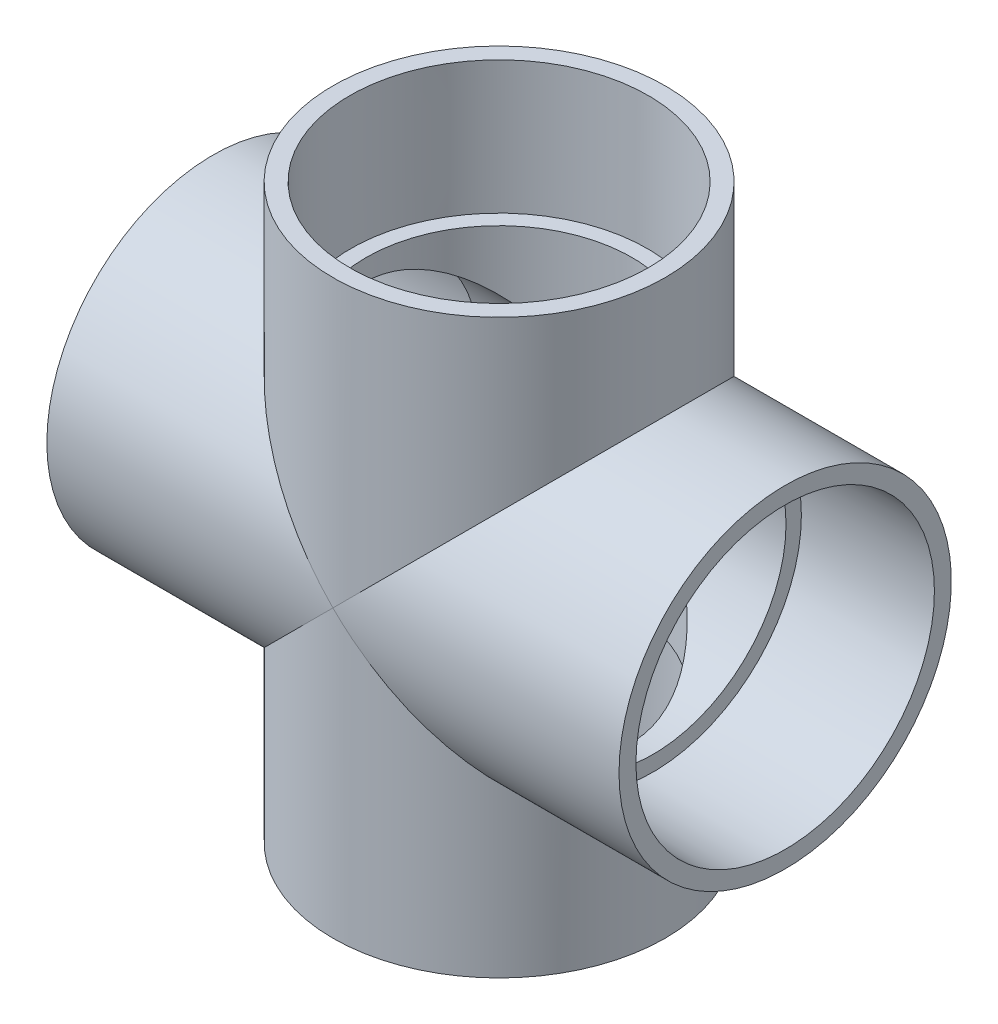
ISO-10303-21;
HEADER;
FILE_DESCRIPTION(('STEP AP214'),'2;1');
FILE_NAME('part.step','',(''),(''),'','','');
FILE_SCHEMA(('AUTOMOTIVE_DESIGN { 1 0 10303 214 1 1 1 1 }'));
ENDSEC;
DATA;
#1=APPLICATION_CONTEXT('core data for automotive mechanical design processes');
#2=APPLICATION_PROTOCOL_DEFINITION('international standard','automotive_design',2000,#1);
#3=PRODUCT_CONTEXT('',#1,'mechanical');
#4=PRODUCT('Part','Part','',(#3));
#5=PRODUCT_RELATED_PRODUCT_CATEGORY('part','',(#4));
#6=PRODUCT_DEFINITION_FORMATION('','',#4);
#7=PRODUCT_DEFINITION_CONTEXT('part definition',#1,'design');
#8=PRODUCT_DEFINITION('design','',#6,#7);
#9=PRODUCT_DEFINITION_SHAPE('','',#8);
#10=(LENGTH_UNIT() NAMED_UNIT(*) SI_UNIT(.MILLI.,.METRE.));
#11=(NAMED_UNIT(*) PLANE_ANGLE_UNIT() SI_UNIT($,.RADIAN.));
#12=(NAMED_UNIT(*) SI_UNIT($,.STERADIAN.) SOLID_ANGLE_UNIT());
#13=UNCERTAINTY_MEASURE_WITH_UNIT(LENGTH_MEASURE(1.E-05),#10,'distance_accuracy_value','');
#14=(GEOMETRIC_REPRESENTATION_CONTEXT(3) GLOBAL_UNCERTAINTY_ASSIGNED_CONTEXT((#13)) GLOBAL_UNIT_ASSIGNED_CONTEXT((#10,
#11,#12)) REPRESENTATION_CONTEXT('',''));
#15=CARTESIAN_POINT('',(0.,0.,0.));
#16=DIRECTION('',(0.,0.,1.));
#17=DIRECTION('',(1.,0.,0.));
#18=AXIS2_PLACEMENT_3D('',#15,#16,#17);
#19=CARTESIAN_POINT('',(0.,59.1819999999998,0.));
#20=DIRECTION('',(0.,-1.,0.));
#21=DIRECTION('',(1.,0.,0.));
#22=AXIS2_PLACEMENT_3D('',#19,#20,#21);
#23=PLANE('',#22);
#24=CARTESIAN_POINT('',(0.,59.1819999999998,0.));
#25=DIRECTION('',(0.,-1.,0.));
#26=DIRECTION('',(1.,0.,0.));
#27=AXIS2_PLACEMENT_3D('',#24,#25,#26);
#28=CIRCLE('',#27,57.0357);
#29=CARTESIAN_POINT('',(57.0357,59.1819999999998,0.));
#30=VERTEX_POINT('',#29);
#31=EDGE_CURVE('E80',#30,#30,#28,.T.);
#32=ORIENTED_EDGE('',*,*,#31,.F.);
#33=EDGE_LOOP('',(#32));
#34=FACE_BOUND('',#33,.T.);
#35=CARTESIAN_POINT('',(0.,59.1819999999998,0.));
#36=DIRECTION('',(0.,1.,0.));
#37=DIRECTION('',(-1.,0.,0.));
#38=AXIS2_PLACEMENT_3D('',#35,#36,#37);
#39=CIRCLE('',#38,51.1302);
#40=CARTESIAN_POINT('',(-51.1302,59.1819999999998,0.));
#41=VERTEX_POINT('',#40);
#42=EDGE_CURVE('E124',#41,#41,#39,.T.);
#43=ORIENTED_EDGE('',*,*,#42,.F.);
#44=EDGE_LOOP('',(#43));
#45=FACE_BOUND('',#44,.T.);
#46=ADVANCED_FACE('F32',(#34,#45),#23,.F.);
#47=CARTESIAN_POINT('',(0.,-59.1819999999998,0.));
#48=DIRECTION('',(0.,-1.,0.));
#49=DIRECTION('',(1.,0.,0.));
#50=AXIS2_PLACEMENT_3D('',#47,#48,#49);
#51=PLANE('',#50);
#52=CARTESIAN_POINT('',(0.,-59.1819999999998,0.));
#53=DIRECTION('',(0.,1.,0.));
#54=DIRECTION('',(-1.,0.,0.));
#55=AXIS2_PLACEMENT_3D('',#52,#53,#54);
#56=CIRCLE('',#55,51.1302);
#57=CARTESIAN_POINT('',(-51.1302,-59.1819999999999,0.));
#58=VERTEX_POINT('',#57);
#59=EDGE_CURVE('E127',#58,#58,#56,.T.);
#60=ORIENTED_EDGE('',*,*,#59,.T.);
#61=EDGE_LOOP('',(#60));
#62=FACE_BOUND('',#61,.T.);
#63=CARTESIAN_POINT('',(0.,-59.1819999999998,0.));
#64=DIRECTION('',(0.,-1.,0.));
#65=DIRECTION('',(1.,0.,0.));
#66=AXIS2_PLACEMENT_3D('',#63,#64,#65);
#67=CIRCLE('',#66,57.0357);
#68=CARTESIAN_POINT('',(57.0357,-59.1819999999998,0.));
#69=VERTEX_POINT('',#68);
#70=EDGE_CURVE('E115',#69,#69,#67,.T.);
#71=ORIENTED_EDGE('',*,*,#70,.T.);
#72=EDGE_LOOP('',(#71));
#73=FACE_BOUND('',#72,.T.);
#74=ADVANCED_FACE('F131',(#62,#73),#51,.T.);
#75=CARTESIAN_POINT('',(109.982,0.,0.));
#76=DIRECTION('',(1.,0.,0.));
#77=DIRECTION('',(0.,0.,-1.));
#78=AXIS2_PLACEMENT_3D('',#75,#76,#77);
#79=CYLINDRICAL_SURFACE('',#78,51.1302);
#80=CARTESIAN_POINT('',(59.1819999999998,0.,0.));
#81=DIRECTION('',(1.,0.,0.));
#82=DIRECTION('',(0.,0.,-1.));
#83=AXIS2_PLACEMENT_3D('',#80,#81,#82);
#84=CIRCLE('',#83,51.1302);
#85=CARTESIAN_POINT('',(59.1819999999998,0.,-51.1302));
#86=VERTEX_POINT('',#85);
#87=EDGE_CURVE('E121',#86,#86,#84,.T.);
#88=ORIENTED_EDGE('',*,*,#87,.T.);
#89=EDGE_LOOP('',(#88));
#90=FACE_BOUND('',#89,.T.);
#91=CARTESIAN_POINT('',(0.,0.,0.));
#92=DIRECTION('',(0.707106781186548,-0.707106781186547,0.));
#93=DIRECTION('',(0.707106781186547,0.707106781186548,0.));
#94=AXIS2_PLACEMENT_3D('',#91,#92,#93);
#95=ELLIPSE('',#94,72.3090222868488,51.1302);
#96=CARTESIAN_POINT('',(0.,0.,51.1302));
#97=VERTEX_POINT('',#96);
#98=CARTESIAN_POINT('',(0.,0.,-51.1302));
#99=VERTEX_POINT('',#98);
#100=EDGE_CURVE('E45',#97,#99,#95,.F.);
#101=ORIENTED_EDGE('',*,*,#100,.T.);
#102=CARTESIAN_POINT('',(0.,0.,0.));
#103=DIRECTION('',(0.707106781186547,0.707106781186548,0.));
#104=DIRECTION('',(0.707106781186548,-0.707106781186547,0.));
#105=AXIS2_PLACEMENT_3D('',#102,#103,#104);
#106=ELLIPSE('',#105,72.3090222868488,51.1302);
#107=EDGE_CURVE('E11',#99,#97,#106,.F.);
#108=ORIENTED_EDGE('',*,*,#107,.T.);
#109=EDGE_LOOP('',(#101,#108));
#110=FACE_BOUND('',#109,.T.);
#111=ADVANCED_FACE('F72',(#90,#110),#79,.F.);
#112=CARTESIAN_POINT('',(-59.1819999999998,0.,0.));
#113=DIRECTION('',(1.,0.,0.));
#114=DIRECTION('',(0.,0.,-1.));
#115=AXIS2_PLACEMENT_3D('',#112,#113,#114);
#116=CIRCLE('',#115,51.1302);
#117=CARTESIAN_POINT('',(-59.1819999999998,0.,-51.1302));
#118=VERTEX_POINT('',#117);
#119=EDGE_CURVE('E118',#118,#118,#116,.T.);
#120=ORIENTED_EDGE('',*,*,#119,.F.);
#121=EDGE_LOOP('',(#120));
#122=FACE_BOUND('',#121,.T.);
#123=CARTESIAN_POINT('',(0.,0.,0.));
#124=DIRECTION('',(0.707106781186548,-0.707106781186547,0.));
#125=DIRECTION('',(0.707106781186547,0.707106781186548,0.));
#126=AXIS2_PLACEMENT_3D('',#123,#124,#125);
#127=ELLIPSE('',#126,72.3090222868488,51.1302);
#128=EDGE_CURVE('E62',#97,#99,#127,.T.);
#129=ORIENTED_EDGE('',*,*,#128,.T.);
#130=CARTESIAN_POINT('',(0.,0.,0.));
#131=DIRECTION('',(0.707106781186547,0.707106781186548,0.));
#132=DIRECTION('',(0.707106781186548,-0.707106781186547,0.));
#133=AXIS2_PLACEMENT_3D('',#130,#131,#132);
#134=ELLIPSE('',#133,72.3090222868488,51.1302);
#135=EDGE_CURVE('E40',#99,#97,#134,.T.);
#136=ORIENTED_EDGE('',*,*,#135,.T.);
#137=EDGE_LOOP('',(#129,#136));
#138=FACE_BOUND('',#137,.T.);
#139=ADVANCED_FACE('F73',(#122,#138),#79,.F.);
#140=CARTESIAN_POINT('',(-59.1819999999998,0.,0.));
#141=DIRECTION('',(1.,0.,0.));
#142=DIRECTION('',(0.,0.,-1.));
#143=AXIS2_PLACEMENT_3D('',#140,#141,#142);
#144=PLANE('',#143);
#145=ORIENTED_EDGE('',*,*,#119,.T.);
#146=EDGE_LOOP('',(#145));
#147=FACE_BOUND('',#146,.T.);
#148=CARTESIAN_POINT('',(-59.1819999999998,0.,0.));
#149=DIRECTION('',(-1.,0.,0.));
#150=DIRECTION('',(0.,0.,1.));
#151=AXIS2_PLACEMENT_3D('',#148,#149,#150);
#152=CIRCLE('',#151,57.0357);
#153=CARTESIAN_POINT('',(-59.1819999999998,0.,57.0357));
#154=VERTEX_POINT('',#153);
#155=EDGE_CURVE('E92',#154,#154,#152,.T.);
#156=ORIENTED_EDGE('',*,*,#155,.T.);
#157=EDGE_LOOP('',(#156));
#158=FACE_BOUND('',#157,.T.);
#159=ADVANCED_FACE('F179',(#147,#158),#144,.F.);
#160=CARTESIAN_POINT('',(59.1819999999998,0.,0.));
#161=DIRECTION('',(1.,0.,0.));
#162=DIRECTION('',(0.,0.,-1.));
#163=AXIS2_PLACEMENT_3D('',#160,#161,#162);
#164=PLANE('',#163);
#165=CARTESIAN_POINT('',(59.1819999999998,0.,0.));
#166=DIRECTION('',(1.,0.,0.));
#167=DIRECTION('',(0.,0.,-1.));
#168=AXIS2_PLACEMENT_3D('',#165,#166,#167);
#169=CIRCLE('',#168,57.0357);
#170=CARTESIAN_POINT('',(59.1819999999998,0.,-57.0357));
#171=VERTEX_POINT('',#170);
#172=EDGE_CURVE('E70',#171,#171,#169,.F.);
#173=ORIENTED_EDGE('',*,*,#172,.F.);
#174=EDGE_LOOP('',(#173));
#175=FACE_BOUND('',#174,.T.);
#176=ORIENTED_EDGE('',*,*,#87,.F.);
#177=EDGE_LOOP('',(#176));
#178=FACE_BOUND('',#177,.T.);
#179=ADVANCED_FACE('F175',(#175,#178),#164,.T.);
#180=CARTESIAN_POINT('',(59.1819999999998,0.,0.));
#181=DIRECTION('',(-1.,0.,0.));
#182=DIRECTION('',(0.,0.,1.));
#183=AXIS2_PLACEMENT_3D('',#180,#181,#182);
#184=CYLINDRICAL_SURFACE('',#183,63.881);
#185=CARTESIAN_POINT('',(109.982,0.,0.));
#186=DIRECTION('',(-1.,0.,0.));
#187=DIRECTION('',(0.,0.,1.));
#188=AXIS2_PLACEMENT_3D('',#185,#186,#187);
#189=CIRCLE('',#188,63.881);
#190=CARTESIAN_POINT('',(109.982,0.,63.881));
#191=VERTEX_POINT('',#190);
#192=EDGE_CURVE('E103',#191,#191,#189,.T.);
#193=ORIENTED_EDGE('',*,*,#192,.T.);
#194=EDGE_LOOP('',(#193));
#195=FACE_BOUND('',#194,.T.);
#196=CARTESIAN_POINT('',(0.,0.,0.));
#197=DIRECTION('',(-0.707106781186547,-0.707106781186548,0.));
#198=DIRECTION('',(-0.707106781186547,0.707106781186548,0.));
#199=AXIS2_PLACEMENT_3D('',#196,#197,#198);
#200=ELLIPSE('',#199,90.3413765779557,63.881);
#201=CARTESIAN_POINT('',(0.,0.,-63.8810000000001));
#202=VERTEX_POINT('',#201);
#203=CARTESIAN_POINT('',(0.,0.,63.8810000000001));
#204=VERTEX_POINT('',#203);
#205=EDGE_CURVE('E107',#202,#204,#200,.T.);
#206=ORIENTED_EDGE('',*,*,#205,.F.);
#207=CARTESIAN_POINT('',(0.,0.,0.));
#208=DIRECTION('',(0.707106781186547,-0.707106781186547,0.));
#209=DIRECTION('',(-0.707106781186547,-0.707106781186547,0.));
#210=AXIS2_PLACEMENT_3D('',#207,#208,#209);
#211=ELLIPSE('',#210,90.3413765779557,63.881);
#212=EDGE_CURVE('E98',#202,#204,#211,.T.);
#213=ORIENTED_EDGE('',*,*,#212,.T.);
#214=EDGE_LOOP('',(#206,#213));
#215=FACE_BOUND('',#214,.T.);
#216=ADVANCED_FACE('F178',(#195,#215),#184,.T.);
#217=CARTESIAN_POINT('',(-109.982,0.,0.));
#218=DIRECTION('',(-1.,0.,0.));
#219=DIRECTION('',(0.,0.,1.));
#220=AXIS2_PLACEMENT_3D('',#217,#218,#219);
#221=CIRCLE('',#220,63.881);
#222=CARTESIAN_POINT('',(-109.982,0.,63.881));
#223=VERTEX_POINT('',#222);
#224=EDGE_CURVE('E95',#223,#223,#221,.T.);
#225=ORIENTED_EDGE('',*,*,#224,.F.);
#226=EDGE_LOOP('',(#225));
#227=FACE_BOUND('',#226,.T.);
#228=CARTESIAN_POINT('',(0.,0.,0.));
#229=DIRECTION('',(-0.707106781186547,-0.707106781186547,0.));
#230=DIRECTION('',(0.707106781186547,-0.707106781186547,0.));
#231=AXIS2_PLACEMENT_3D('',#228,#229,#230);
#232=ELLIPSE('',#231,90.3413765779557,63.881);
#233=EDGE_CURVE('E86',#204,#202,#232,.T.);
#234=ORIENTED_EDGE('',*,*,#233,.T.);
#235=CARTESIAN_POINT('',(0.,0.,0.));
#236=DIRECTION('',(-0.707106781186547,0.707106781186548,0.));
#237=DIRECTION('',(-0.707106781186547,-0.707106781186548,0.));
#238=AXIS2_PLACEMENT_3D('',#235,#236,#237);
#239=ELLIPSE('',#238,90.3413765779557,63.881);
#240=EDGE_CURVE('E52',#204,#202,#239,.F.);
#241=ORIENTED_EDGE('',*,*,#240,.F.);
#242=EDGE_LOOP('',(#234,#241));
#243=FACE_BOUND('',#242,.T.);
#244=ADVANCED_FACE('F169',(#227,#243),#184,.T.);
#245=CARTESIAN_POINT('',(-59.1819999999998,0.,0.));
#246=DIRECTION('',(-1.,0.,0.));
#247=DIRECTION('',(0.,0.,1.));
#248=AXIS2_PLACEMENT_3D('',#245,#246,#247);
#249=CONICAL_SURFACE('',#248,57.0357,0.00674989748717743);
#250=CARTESIAN_POINT('',(-109.982,0.,0.));
#251=DIRECTION('',(-1.,0.,0.));
#252=DIRECTION('',(0.,0.,1.));
#253=AXIS2_PLACEMENT_3D('',#250,#251,#252);
#254=CIRCLE('',#253,57.3786);
#255=CARTESIAN_POINT('',(-109.982,0.,57.3786));
#256=VERTEX_POINT('',#255);
#257=EDGE_CURVE('E89',#256,#256,#254,.T.);
#258=ORIENTED_EDGE('',*,*,#257,.T.);
#259=EDGE_LOOP('',(#258));
#260=FACE_BOUND('',#259,.T.);
#261=ORIENTED_EDGE('',*,*,#155,.F.);
#262=EDGE_LOOP('',(#261));
#263=FACE_BOUND('',#262,.T.);
#264=ADVANCED_FACE('F161',(#260,#263),#249,.F.);
#265=CARTESIAN_POINT('',(109.982,0.,0.));
#266=DIRECTION('',(1.,0.,0.));
#267=DIRECTION('',(0.,0.,-1.));
#268=AXIS2_PLACEMENT_3D('',#265,#266,#267);
#269=CONICAL_SURFACE('',#268,57.3786,0.00674989748717716);
#270=CARTESIAN_POINT('',(109.982,0.,0.));
#271=DIRECTION('',(-1.,0.,0.));
#272=DIRECTION('',(0.,0.,1.));
#273=AXIS2_PLACEMENT_3D('',#270,#271,#272);
#274=CIRCLE('',#273,57.3786);
#275=CARTESIAN_POINT('',(109.982,0.,57.3786));
#276=VERTEX_POINT('',#275);
#277=EDGE_CURVE('E100',#276,#276,#274,.T.);
#278=ORIENTED_EDGE('',*,*,#277,.F.);
#279=EDGE_LOOP('',(#278));
#280=FACE_BOUND('',#279,.T.);
#281=ORIENTED_EDGE('',*,*,#172,.T.);
#282=EDGE_LOOP('',(#281));
#283=FACE_BOUND('',#282,.T.);
#284=ADVANCED_FACE('F157',(#280,#283),#269,.F.);
#285=CARTESIAN_POINT('',(0.,109.982,0.));
#286=DIRECTION('',(0.,1.,0.));
#287=DIRECTION('',(-1.,0.,0.));
#288=AXIS2_PLACEMENT_3D('',#285,#286,#287);
#289=CONICAL_SURFACE('',#288,57.3786,0.00674989748717743);
#290=CARTESIAN_POINT('',(0.,109.982,0.));
#291=DIRECTION('',(0.,-1.,0.));
#292=DIRECTION('',(1.,0.,0.));
#293=AXIS2_PLACEMENT_3D('',#290,#291,#292);
#294=CIRCLE('',#293,57.3786);
#295=CARTESIAN_POINT('',(57.3786,109.982,0.));
#296=VERTEX_POINT('',#295);
#297=EDGE_CURVE('E83',#296,#296,#294,.T.);
#298=ORIENTED_EDGE('',*,*,#297,.F.);
#299=EDGE_LOOP('',(#298));
#300=FACE_BOUND('',#299,.T.);
#301=ORIENTED_EDGE('',*,*,#31,.T.);
#302=EDGE_LOOP('',(#301));
#303=FACE_BOUND('',#302,.T.);
#304=ADVANCED_FACE('F160',(#300,#303),#289,.F.);
#305=CARTESIAN_POINT('',(63.8809999999999,109.982,0.));
#306=DIRECTION('',(0.,1.,0.));
#307=DIRECTION('',(-1.,0.,0.));
#308=AXIS2_PLACEMENT_3D('',#305,#306,#307);
#309=PLANE('',#308);
#310=ORIENTED_EDGE('',*,*,#297,.T.);
#311=EDGE_LOOP('',(#310));
#312=FACE_BOUND('',#311,.T.);
#313=CARTESIAN_POINT('',(0.,109.982,0.));
#314=DIRECTION('',(0.,-1.,0.));
#315=DIRECTION('',(1.,0.,0.));
#316=AXIS2_PLACEMENT_3D('',#313,#314,#315);
#317=CIRCLE('',#316,63.881);
#318=CARTESIAN_POINT('',(63.881,109.982,0.));
#319=VERTEX_POINT('',#318);
#320=EDGE_CURVE('E77',#319,#319,#317,.T.);
#321=ORIENTED_EDGE('',*,*,#320,.F.);
#322=EDGE_LOOP('',(#321));
#323=FACE_BOUND('',#322,.T.);
#324=ADVANCED_FACE('F34',(#312,#323),#309,.T.);
#325=CARTESIAN_POINT('',(0.,0.,0.));
#326=DIRECTION('',(0.,-1.,0.));
#327=DIRECTION('',(1.,0.,0.));
#328=AXIS2_PLACEMENT_3D('',#325,#326,#327);
#329=CYLINDRICAL_SURFACE('',#328,63.881);
#330=ORIENTED_EDGE('',*,*,#212,.F.);
#331=ORIENTED_EDGE('',*,*,#233,.F.);
#332=EDGE_LOOP('',(#330,#331));
#333=FACE_BOUND('',#332,.T.);
#334=ORIENTED_EDGE('',*,*,#320,.T.);
#335=EDGE_LOOP('',(#334));
#336=FACE_BOUND('',#335,.T.);
#337=ADVANCED_FACE('F173',(#333,#336),#329,.T.);
#338=CARTESIAN_POINT('',(-109.982,-63.8809999999999,0.));
#339=DIRECTION('',(-1.,0.,0.));
#340=DIRECTION('',(0.,0.,1.));
#341=AXIS2_PLACEMENT_3D('',#338,#339,#340);
#342=PLANE('',#341);
#343=ORIENTED_EDGE('',*,*,#224,.T.);
#344=EDGE_LOOP('',(#343));
#345=FACE_BOUND('',#344,.T.);
#346=ORIENTED_EDGE('',*,*,#257,.F.);
#347=EDGE_LOOP('',(#346));
#348=FACE_BOUND('',#347,.T.);
#349=ADVANCED_FACE('F165',(#345,#348),#342,.T.);
#350=CARTESIAN_POINT('',(109.982,-63.8809999999999,0.));
#351=DIRECTION('',(1.,0.,0.));
#352=DIRECTION('',(0.,0.,-1.));
#353=AXIS2_PLACEMENT_3D('',#350,#351,#352);
#354=PLANE('',#353);
#355=ORIENTED_EDGE('',*,*,#277,.T.);
#356=EDGE_LOOP('',(#355));
#357=FACE_BOUND('',#356,.T.);
#358=ORIENTED_EDGE('',*,*,#192,.F.);
#359=EDGE_LOOP('',(#358));
#360=FACE_BOUND('',#359,.T.);
#361=ADVANCED_FACE('F156',(#357,#360),#354,.T.);
#362=CARTESIAN_POINT('',(0.,-59.1819999999998,0.));
#363=DIRECTION('',(0.,1.,0.));
#364=DIRECTION('',(-1.,0.,0.));
#365=AXIS2_PLACEMENT_3D('',#362,#363,#364);
#366=CYLINDRICAL_SURFACE('',#365,63.881);
#367=ORIENTED_EDGE('',*,*,#205,.T.);
#368=ORIENTED_EDGE('',*,*,#240,.T.);
#369=EDGE_LOOP('',(#367,#368));
#370=FACE_BOUND('',#369,.T.);
#371=CARTESIAN_POINT('',(0.,-109.982,0.));
#372=DIRECTION('',(0.,-1.,0.));
#373=DIRECTION('',(1.,0.,0.));
#374=AXIS2_PLACEMENT_3D('',#371,#372,#373);
#375=CIRCLE('',#374,63.881);
#376=CARTESIAN_POINT('',(63.881,-109.982,0.));
#377=VERTEX_POINT('',#376);
#378=EDGE_CURVE('E109',#377,#377,#375,.T.);
#379=ORIENTED_EDGE('',*,*,#378,.F.);
#380=EDGE_LOOP('',(#379));
#381=FACE_BOUND('',#380,.T.);
#382=ADVANCED_FACE('F152',(#370,#381),#366,.T.);
#383=CARTESIAN_POINT('',(0.,-59.1819999999998,0.));
#384=DIRECTION('',(0.,-1.,0.));
#385=DIRECTION('',(1.,0.,0.));
#386=AXIS2_PLACEMENT_3D('',#383,#384,#385);
#387=CONICAL_SURFACE('',#386,57.0357,0.00674989748717743);
#388=CARTESIAN_POINT('',(0.,-109.982,0.));
#389=DIRECTION('',(0.,-1.,0.));
#390=DIRECTION('',(1.,0.,0.));
#391=AXIS2_PLACEMENT_3D('',#388,#389,#390);
#392=CIRCLE('',#391,57.3786);
#393=CARTESIAN_POINT('',(57.3786,-109.982,0.));
#394=VERTEX_POINT('',#393);
#395=EDGE_CURVE('E112',#394,#394,#392,.T.);
#396=ORIENTED_EDGE('',*,*,#395,.T.);
#397=EDGE_LOOP('',(#396));
#398=FACE_BOUND('',#397,.T.);
#399=ORIENTED_EDGE('',*,*,#70,.F.);
#400=EDGE_LOOP('',(#399));
#401=FACE_BOUND('',#400,.T.);
#402=ADVANCED_FACE('F155',(#398,#401),#387,.F.);
#403=CARTESIAN_POINT('',(63.8809999999999,-109.982,0.));
#404=DIRECTION('',(0.,-1.,0.));
#405=DIRECTION('',(1.,0.,0.));
#406=AXIS2_PLACEMENT_3D('',#403,#404,#405);
#407=PLANE('',#406);
#408=ORIENTED_EDGE('',*,*,#378,.T.);
#409=EDGE_LOOP('',(#408));
#410=FACE_BOUND('',#409,.T.);
#411=ORIENTED_EDGE('',*,*,#395,.F.);
#412=EDGE_LOOP('',(#411));
#413=FACE_BOUND('',#412,.T.);
#414=ADVANCED_FACE('F138',(#410,#413),#407,.T.);
#415=CARTESIAN_POINT('',(0.,109.982,0.));
#416=DIRECTION('',(0.,1.,0.));
#417=DIRECTION('',(-1.,0.,0.));
#418=AXIS2_PLACEMENT_3D('',#415,#416,#417);
#419=CYLINDRICAL_SURFACE('',#418,51.1302);
#420=ORIENTED_EDGE('',*,*,#42,.T.);
#421=EDGE_LOOP('',(#420));
#422=FACE_BOUND('',#421,.T.);
#423=ORIENTED_EDGE('',*,*,#100,.F.);
#424=ORIENTED_EDGE('',*,*,#135,.F.);
#425=EDGE_LOOP('',(#423,#424));
#426=FACE_BOUND('',#425,.T.);
#427=ADVANCED_FACE('F69',(#422,#426),#419,.F.);
#428=ORIENTED_EDGE('',*,*,#128,.F.);
#429=ORIENTED_EDGE('',*,*,#107,.F.);
#430=EDGE_LOOP('',(#428,#429));
#431=FACE_BOUND('',#430,.T.);
#432=ORIENTED_EDGE('',*,*,#59,.F.);
#433=EDGE_LOOP('',(#432));
#434=FACE_BOUND('',#433,.T.);
#435=ADVANCED_FACE('F63',(#431,#434),#419,.F.);
#436=CLOSED_SHELL('',(#46,#74,#111,#139,#159,#179,#216,#244,#264,#284,#304,#324,#337,#349,#361,
#382,#402,#414,#427,#435));
#437=MANIFOLD_SOLID_BREP('B2',#436);
#438=ADVANCED_BREP_SHAPE_REPRESENTATION('',(#18,#437),#14);
#439=SHAPE_DEFINITION_REPRESENTATION(#9,#438);
ENDSEC;
END-ISO-10303-21;
